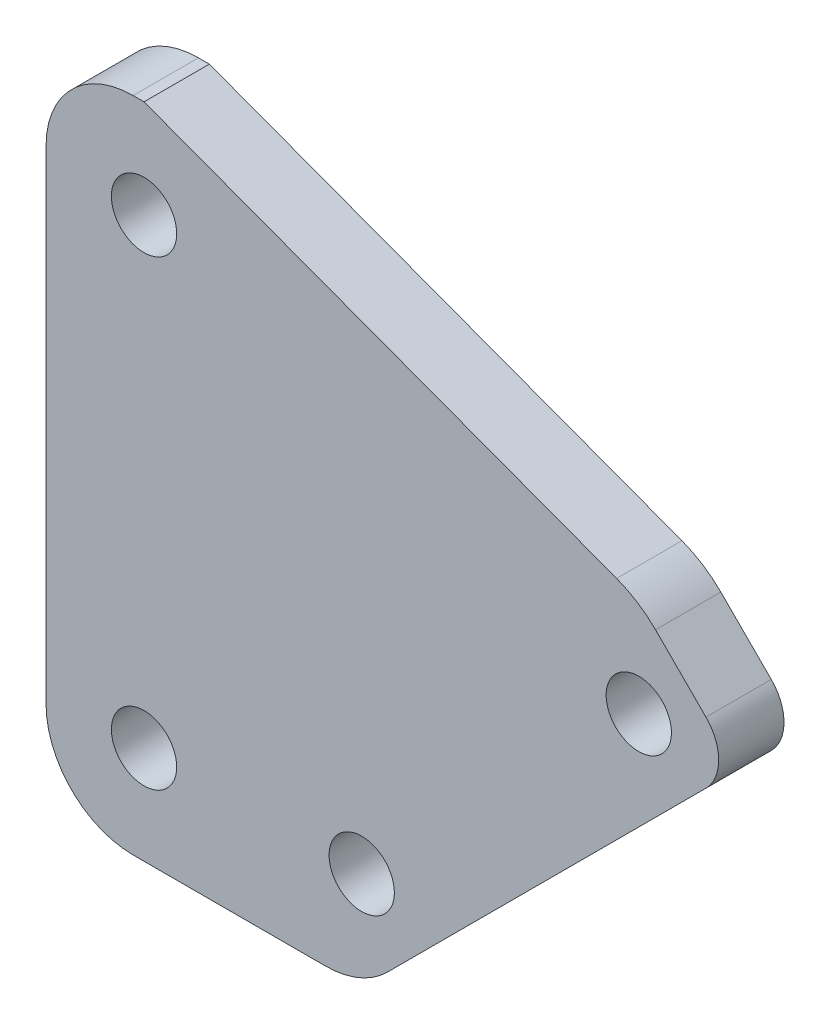
ISO-10303-21;
HEADER;
FILE_DESCRIPTION(('STEP AP214'),'2;1');
FILE_NAME('part.step','',(''),(''),'','','');
FILE_SCHEMA(('AUTOMOTIVE_DESIGN { 1 0 10303 214 1 1 1 1 }'));
ENDSEC;
DATA;
#1=APPLICATION_CONTEXT('core data for automotive mechanical design processes');
#2=APPLICATION_PROTOCOL_DEFINITION('international standard','automotive_design',2000,#1);
#3=PRODUCT_CONTEXT('',#1,'mechanical');
#4=PRODUCT('Part','Part','',(#3));
#5=PRODUCT_RELATED_PRODUCT_CATEGORY('part','',(#4));
#6=PRODUCT_DEFINITION_FORMATION('','',#4);
#7=PRODUCT_DEFINITION_CONTEXT('part definition',#1,'design');
#8=PRODUCT_DEFINITION('design','',#6,#7);
#9=PRODUCT_DEFINITION_SHAPE('','',#8);
#10=(LENGTH_UNIT() NAMED_UNIT(*) SI_UNIT(.MILLI.,.METRE.));
#11=(NAMED_UNIT(*) PLANE_ANGLE_UNIT() SI_UNIT($,.RADIAN.));
#12=(NAMED_UNIT(*) SI_UNIT($,.STERADIAN.) SOLID_ANGLE_UNIT());
#13=UNCERTAINTY_MEASURE_WITH_UNIT(LENGTH_MEASURE(1.E-05),#10,'distance_accuracy_value','');
#14=(GEOMETRIC_REPRESENTATION_CONTEXT(3) GLOBAL_UNCERTAINTY_ASSIGNED_CONTEXT((#13)) GLOBAL_UNIT_ASSIGNED_CONTEXT((#10,
#11,#12)) REPRESENTATION_CONTEXT('',''));
#15=CARTESIAN_POINT('',(0.,0.,0.));
#16=DIRECTION('',(0.,0.,1.));
#17=DIRECTION('',(1.,0.,0.));
#18=AXIS2_PLACEMENT_3D('',#15,#16,#17);
#19=CARTESIAN_POINT('',(12.8431457505076,4.,3.));
#20=DIRECTION('',(0.,0.,-1.));
#21=DIRECTION('',(-1.,0.,0.));
#22=AXIS2_PLACEMENT_3D('',#19,#20,#21);
#23=CYLINDRICAL_SURFACE('',#22,4.);
#24=DIRECTION('',(0.,0.,1.));
#25=VECTOR('',#24,1.);
#26=CARTESIAN_POINT('',(12.8431457505076,0.,3.));
#27=LINE('',#26,#25);
#28=CARTESIAN_POINT('',(12.8431457505076,0.,0.));
#29=VERTEX_POINT('',#28);
#30=CARTESIAN_POINT('',(12.8431457505076,0.,3.));
#31=VERTEX_POINT('',#30);
#32=EDGE_CURVE('E234',#29,#31,#27,.T.);
#33=ORIENTED_EDGE('',*,*,#32,.F.);
#34=CARTESIAN_POINT('',(12.8431457505076,4.,0.));
#35=DIRECTION('',(0.,0.,1.));
#36=DIRECTION('',(1.,0.,0.));
#37=AXIS2_PLACEMENT_3D('',#34,#35,#36);
#38=CIRCLE('',#37,4.);
#39=CARTESIAN_POINT('',(15.6715728752538,1.17157287525381,0.));
#40=VERTEX_POINT('',#39);
#41=EDGE_CURVE('E52',#40,#29,#38,.F.);
#42=ORIENTED_EDGE('',*,*,#41,.F.);
#43=DIRECTION('',(0.,0.,1.));
#44=VECTOR('',#43,1.);
#45=CARTESIAN_POINT('',(15.6715728752538,1.17157287525381,3.));
#46=LINE('',#45,#44);
#47=CARTESIAN_POINT('',(15.6715728752538,1.17157287525381,3.));
#48=VERTEX_POINT('',#47);
#49=EDGE_CURVE('E237',#48,#40,#46,.F.);
#50=ORIENTED_EDGE('',*,*,#49,.F.);
#51=CARTESIAN_POINT('',(12.8431457505076,4.,3.));
#52=DIRECTION('',(0.,0.,1.));
#53=DIRECTION('',(1.,0.,0.));
#54=AXIS2_PLACEMENT_3D('',#51,#52,#53);
#55=CIRCLE('',#54,4.);
#56=EDGE_CURVE('E11',#31,#48,#55,.T.);
#57=ORIENTED_EDGE('',*,*,#56,.F.);
#58=EDGE_LOOP('',(#33,#42,#50,#57));
#59=FACE_BOUND('',#58,.T.);
#60=ADVANCED_FACE('F45',(#59),#23,.T.);
#61=CARTESIAN_POINT('',(4.,4.,3.));
#62=DIRECTION('',(0.,0.,-1.));
#63=DIRECTION('',(-1.,0.,0.));
#64=AXIS2_PLACEMENT_3D('',#61,#62,#63);
#65=CYLINDRICAL_SURFACE('',#64,4.);
#66=DIRECTION('',(0.,0.,1.));
#67=VECTOR('',#66,1.);
#68=CARTESIAN_POINT('',(0.,4.,3.));
#69=LINE('',#68,#67);
#70=CARTESIAN_POINT('',(0.,4.,0.));
#71=VERTEX_POINT('',#70);
#72=CARTESIAN_POINT('',(0.,4.,3.));
#73=VERTEX_POINT('',#72);
#74=EDGE_CURVE('E224',#71,#73,#69,.T.);
#75=ORIENTED_EDGE('',*,*,#74,.F.);
#76=CARTESIAN_POINT('',(4.,4.,0.));
#77=DIRECTION('',(0.,0.,1.));
#78=DIRECTION('',(1.,0.,0.));
#79=AXIS2_PLACEMENT_3D('',#76,#77,#78);
#80=CIRCLE('',#79,4.);
#81=CARTESIAN_POINT('',(4.,0.,0.));
#82=VERTEX_POINT('',#81);
#83=EDGE_CURVE('E230',#82,#71,#80,.F.);
#84=ORIENTED_EDGE('',*,*,#83,.F.);
#85=DIRECTION('',(0.,0.,1.));
#86=VECTOR('',#85,1.);
#87=CARTESIAN_POINT('',(4.,0.,3.));
#88=LINE('',#87,#86);
#89=CARTESIAN_POINT('',(4.,0.,3.));
#90=VERTEX_POINT('',#89);
#91=EDGE_CURVE('E227',#90,#82,#88,.F.);
#92=ORIENTED_EDGE('',*,*,#91,.F.);
#93=CARTESIAN_POINT('',(4.,4.,3.));
#94=DIRECTION('',(0.,0.,1.));
#95=DIRECTION('',(1.,0.,0.));
#96=AXIS2_PLACEMENT_3D('',#93,#94,#95);
#97=CIRCLE('',#96,4.);
#98=EDGE_CURVE('E232',#73,#90,#97,.T.);
#99=ORIENTED_EDGE('',*,*,#98,.F.);
#100=EDGE_LOOP('',(#75,#84,#92,#99));
#101=FACE_BOUND('',#100,.T.);
#102=ADVANCED_FACE('F249',(#101),#65,.T.);
#103=CARTESIAN_POINT('',(4.,26.2132034355964,3.));
#104=DIRECTION('',(0.,0.,-1.));
#105=DIRECTION('',(-1.,0.,0.));
#106=AXIS2_PLACEMENT_3D('',#103,#104,#105);
#107=CYLINDRICAL_SURFACE('',#106,4.);
#108=DIRECTION('',(0.,0.,-1.));
#109=VECTOR('',#108,1.);
#110=CARTESIAN_POINT('',(0.,26.2132034355964,3.));
#111=LINE('',#110,#109);
#112=CARTESIAN_POINT('',(0.,26.2132034355964,3.));
#113=VERTEX_POINT('',#112);
#114=CARTESIAN_POINT('',(0.,26.2132034355964,0.));
#115=VERTEX_POINT('',#114);
#116=EDGE_CURVE('E216',#113,#115,#111,.T.);
#117=ORIENTED_EDGE('',*,*,#116,.F.);
#118=CARTESIAN_POINT('',(4.,26.2132034355964,3.));
#119=DIRECTION('',(0.,0.,1.));
#120=DIRECTION('',(1.,0.,0.));
#121=AXIS2_PLACEMENT_3D('',#118,#119,#120);
#122=CIRCLE('',#121,4.);
#123=CARTESIAN_POINT('',(4.,30.2132034355964,3.));
#124=VERTEX_POINT('',#123);
#125=EDGE_CURVE('E220',#124,#113,#122,.T.);
#126=ORIENTED_EDGE('',*,*,#125,.F.);
#127=DIRECTION('',(0.,0.,-1.));
#128=VECTOR('',#127,1.);
#129=CARTESIAN_POINT('',(4.,30.2132034355964,3.));
#130=LINE('',#129,#128);
#131=CARTESIAN_POINT('',(4.,30.2132034355964,0.));
#132=VERTEX_POINT('',#131);
#133=EDGE_CURVE('E133',#132,#124,#130,.F.);
#134=ORIENTED_EDGE('',*,*,#133,.F.);
#135=CARTESIAN_POINT('',(4.,26.2132034355964,0.));
#136=DIRECTION('',(0.,0.,1.));
#137=DIRECTION('',(1.,0.,0.));
#138=AXIS2_PLACEMENT_3D('',#135,#136,#137);
#139=CIRCLE('',#138,4.);
#140=EDGE_CURVE('E222',#115,#132,#139,.F.);
#141=ORIENTED_EDGE('',*,*,#140,.F.);
#142=EDGE_LOOP('',(#117,#126,#134,#141));
#143=FACE_BOUND('',#142,.T.);
#144=ADVANCED_FACE('F255',(#143),#107,.T.);
#145=CARTESIAN_POINT('',(24.4609098339235,17.4238664769267,3.));
#146=DIRECTION('',(0.,0.,1.));
#147=DIRECTION('',(1.,0.,0.));
#148=AXIS2_PLACEMENT_3D('',#145,#146,#147);
#149=CYLINDRICAL_SURFACE('',#148,5.);
#150=DIRECTION('',(0.,0.,1.));
#151=VECTOR('',#150,1.);
#152=CARTESIAN_POINT('',(27.9964437398562,20.9594003828594,3.));
#153=LINE('',#152,#151);
#154=CARTESIAN_POINT('',(27.9964437398562,20.9594003828594,0.));
#155=VERTEX_POINT('',#154);
#156=CARTESIAN_POINT('',(27.9964437398562,20.9594003828594,3.));
#157=VERTEX_POINT('',#156);
#158=EDGE_CURVE('E208',#155,#157,#153,.T.);
#159=ORIENTED_EDGE('',*,*,#158,.F.);
#160=CARTESIAN_POINT('',(24.4609098339235,17.4238664769267,0.));
#161=DIRECTION('',(0.,0.,1.));
#162=DIRECTION('',(1.,0.,0.));
#163=AXIS2_PLACEMENT_3D('',#160,#161,#162);
#164=CIRCLE('',#163,5.);
#165=CARTESIAN_POINT('',(26.2097151151635,22.1080611876862,0.));
#166=VERTEX_POINT('',#165);
#167=EDGE_CURVE('E213',#166,#155,#164,.F.);
#168=ORIENTED_EDGE('',*,*,#167,.F.);
#169=DIRECTION('',(0.,0.,1.));
#170=VECTOR('',#169,1.);
#171=CARTESIAN_POINT('',(26.2097151151635,22.1080611876862,3.));
#172=LINE('',#171,#170);
#173=CARTESIAN_POINT('',(26.2097151151635,22.1080611876862,3.));
#174=VERTEX_POINT('',#173);
#175=EDGE_CURVE('E211',#174,#166,#172,.F.);
#176=ORIENTED_EDGE('',*,*,#175,.F.);
#177=CARTESIAN_POINT('',(24.4609098339235,17.4238664769267,3.));
#178=DIRECTION('',(0.,0.,1.));
#179=DIRECTION('',(1.,0.,0.));
#180=AXIS2_PLACEMENT_3D('',#177,#178,#179);
#181=CIRCLE('',#180,5.);
#182=EDGE_CURVE('E151',#157,#174,#181,.T.);
#183=ORIENTED_EDGE('',*,*,#182,.F.);
#184=EDGE_LOOP('',(#159,#168,#176,#183));
#185=FACE_BOUND('',#184,.T.);
#186=ADVANCED_FACE('F277',(#185),#149,.T.);
#187=CARTESIAN_POINT('',(28.8994949366117,17.2279220613578,3.));
#188=DIRECTION('',(0.,0.,1.));
#189=DIRECTION('',(1.,0.,0.));
#190=AXIS2_PLACEMENT_3D('',#187,#188,#189);
#191=CYLINDRICAL_SURFACE('',#190,2.);
#192=DIRECTION('',(0.,0.,1.));
#193=VECTOR('',#192,1.);
#194=CARTESIAN_POINT('',(30.3137084989847,15.8137084989848,3.));
#195=LINE('',#194,#193);
#196=CARTESIAN_POINT('',(30.3137084989847,15.8137084989848,0.));
#197=VERTEX_POINT('',#196);
#198=CARTESIAN_POINT('',(30.3137084989847,15.8137084989848,3.));
#199=VERTEX_POINT('',#198);
#200=EDGE_CURVE('E145',#197,#199,#195,.T.);
#201=ORIENTED_EDGE('',*,*,#200,.F.);
#202=CARTESIAN_POINT('',(28.8994949366117,17.2279220613578,0.));
#203=DIRECTION('',(0.,0.,1.));
#204=DIRECTION('',(1.,0.,0.));
#205=AXIS2_PLACEMENT_3D('',#202,#203,#204);
#206=CIRCLE('',#205,2.);
#207=CARTESIAN_POINT('',(30.3137084989847,18.6421356237309,0.));
#208=VERTEX_POINT('',#207);
#209=EDGE_CURVE('E203',#208,#197,#206,.F.);
#210=ORIENTED_EDGE('',*,*,#209,.F.);
#211=DIRECTION('',(0.,0.,1.));
#212=VECTOR('',#211,1.);
#213=CARTESIAN_POINT('',(30.3137084989847,18.6421356237309,3.));
#214=LINE('',#213,#212);
#215=CARTESIAN_POINT('',(30.3137084989847,18.6421356237309,3.));
#216=VERTEX_POINT('',#215);
#217=EDGE_CURVE('E200',#216,#208,#214,.F.);
#218=ORIENTED_EDGE('',*,*,#217,.F.);
#219=CARTESIAN_POINT('',(28.8994949366117,17.2279220613578,3.));
#220=DIRECTION('',(0.,0.,1.));
#221=DIRECTION('',(1.,0.,0.));
#222=AXIS2_PLACEMENT_3D('',#219,#220,#221);
#223=CIRCLE('',#222,2.);
#224=EDGE_CURVE('E205',#199,#216,#223,.T.);
#225=ORIENTED_EDGE('',*,*,#224,.F.);
#226=EDGE_LOOP('',(#201,#210,#218,#225));
#227=FACE_BOUND('',#226,.T.);
#228=ADVANCED_FACE('F282',(#227),#191,.T.);
#229=CARTESIAN_POINT('',(7.24999999999999,-7.25,3.));
#230=DIRECTION('',(0.707106781186547,-0.707106781186548,0.));
#231=DIRECTION('',(0.707106781186548,0.707106781186547,0.));
#232=AXIS2_PLACEMENT_3D('',#229,#230,#231);
#233=PLANE('',#232);
#234=DIRECTION('',(-0.707106781186548,-0.707106781186547,0.));
#235=VECTOR('',#234,1.);
#236=CARTESIAN_POINT('',(7.24999999999999,-7.25,3.));
#237=LINE('',#236,#235);
#238=EDGE_CURVE('E155',#199,#48,#237,.T.);
#239=ORIENTED_EDGE('',*,*,#238,.T.);
#240=ORIENTED_EDGE('',*,*,#49,.T.);
#241=DIRECTION('',(-0.707106781186548,-0.707106781186547,0.));
#242=VECTOR('',#241,1.);
#243=CARTESIAN_POINT('',(7.24999999999999,-7.25,0.));
#244=LINE('',#243,#242);
#245=EDGE_CURVE('E173',#197,#40,#244,.T.);
#246=ORIENTED_EDGE('',*,*,#245,.F.);
#247=ORIENTED_EDGE('',*,*,#200,.T.);
#248=EDGE_LOOP('',(#239,#240,#246,#247));
#249=FACE_BOUND('',#248,.T.);
#250=ADVANCED_FACE('F286',(#249),#233,.T.);
#251=CARTESIAN_POINT('',(24.4779220613578,24.4779220613578,3.));
#252=DIRECTION('',(0.707106781186547,0.707106781186547,0.));
#253=DIRECTION('',(-0.707106781186548,0.707106781186548,0.));
#254=AXIS2_PLACEMENT_3D('',#251,#252,#253);
#255=PLANE('',#254);
#256=DIRECTION('',(0.707106781186548,-0.707106781186548,0.));
#257=VECTOR('',#256,1.);
#258=CARTESIAN_POINT('',(24.4779220613578,24.4779220613578,0.));
#259=LINE('',#258,#257);
#260=EDGE_CURVE('E176',#155,#208,#259,.T.);
#261=ORIENTED_EDGE('',*,*,#260,.F.);
#262=ORIENTED_EDGE('',*,*,#158,.T.);
#263=DIRECTION('',(0.707106781186548,-0.707106781186548,0.));
#264=VECTOR('',#263,1.);
#265=CARTESIAN_POINT('',(24.4779220613578,24.4779220613578,3.));
#266=LINE('',#265,#264);
#267=EDGE_CURVE('E153',#157,#216,#266,.T.);
#268=ORIENTED_EDGE('',*,*,#267,.T.);
#269=ORIENTED_EDGE('',*,*,#217,.T.);
#270=EDGE_LOOP('',(#261,#262,#268,#269));
#271=FACE_BOUND('',#270,.T.);
#272=ADVANCED_FACE('F290',(#271),#255,.T.);
#273=CARTESIAN_POINT('',(10.4504512447422,27.9916517698077,3.));
#274=DIRECTION('',(0.349761056248004,0.936838942151894,0.));
#275=DIRECTION('',(-0.936838942151894,0.349761056248004,0.));
#276=AXIS2_PLACEMENT_3D('',#273,#274,#275);
#277=PLANE('',#276);
#278=DIRECTION('',(0.936838942151894,-0.349761056248004,0.));
#279=VECTOR('',#278,1.);
#280=CARTESIAN_POINT('',(10.4504512447422,27.9916517698077,3.));
#281=LINE('',#280,#279);
#282=CARTESIAN_POINT('',(4.49999999999999,30.2132034355964,3.));
#283=VERTEX_POINT('',#282);
#284=EDGE_CURVE('E137',#283,#174,#281,.T.);
#285=ORIENTED_EDGE('',*,*,#284,.T.);
#286=ORIENTED_EDGE('',*,*,#175,.T.);
#287=DIRECTION('',(0.936838942151894,-0.349761056248004,0.));
#288=VECTOR('',#287,1.);
#289=CARTESIAN_POINT('',(10.4504512447422,27.9916517698077,0.));
#290=LINE('',#289,#288);
#291=CARTESIAN_POINT('',(4.49999999999999,30.2132034355964,0.));
#292=VERTEX_POINT('',#291);
#293=EDGE_CURVE('E144',#292,#166,#290,.T.);
#294=ORIENTED_EDGE('',*,*,#293,.F.);
#295=DIRECTION('',(0.,0.,-1.));
#296=VECTOR('',#295,1.);
#297=CARTESIAN_POINT('',(4.49999999999999,30.2132034355964,3.));
#298=LINE('',#297,#296);
#299=EDGE_CURVE('E130',#283,#292,#298,.T.);
#300=ORIENTED_EDGE('',*,*,#299,.F.);
#301=EDGE_LOOP('',(#285,#286,#294,#300));
#302=FACE_BOUND('',#301,.T.);
#303=ADVANCED_FACE('F141',(#302),#277,.T.);
#304=CARTESIAN_POINT('',(0.,30.2132034355964,3.));
#305=DIRECTION('',(0.,1.,0.));
#306=DIRECTION('',(0.,0.,1.));
#307=AXIS2_PLACEMENT_3D('',#304,#305,#306);
#308=PLANE('',#307);
#309=DIRECTION('',(1.,0.,0.));
#310=VECTOR('',#309,1.);
#311=CARTESIAN_POINT('',(0.,30.2132034355964,0.));
#312=LINE('',#311,#310);
#313=EDGE_CURVE('E179',#132,#292,#312,.T.);
#314=ORIENTED_EDGE('',*,*,#313,.F.);
#315=ORIENTED_EDGE('',*,*,#133,.T.);
#316=DIRECTION('',(1.,0.,0.));
#317=VECTOR('',#316,1.);
#318=CARTESIAN_POINT('',(0.,30.2132034355964,3.));
#319=LINE('',#318,#317);
#320=EDGE_CURVE('E126',#124,#283,#319,.T.);
#321=ORIENTED_EDGE('',*,*,#320,.T.);
#322=ORIENTED_EDGE('',*,*,#299,.T.);
#323=EDGE_LOOP('',(#314,#315,#321,#322));
#324=FACE_BOUND('',#323,.T.);
#325=ADVANCED_FACE('F129',(#324),#308,.T.);
#326=CARTESIAN_POINT('',(0.,0.,3.));
#327=DIRECTION('',(-1.,0.,0.));
#328=DIRECTION('',(0.,0.,1.));
#329=AXIS2_PLACEMENT_3D('',#326,#327,#328);
#330=PLANE('',#329);
#331=DIRECTION('',(0.,1.,0.));
#332=VECTOR('',#331,1.);
#333=CARTESIAN_POINT('',(0.,0.,0.));
#334=LINE('',#333,#332);
#335=EDGE_CURVE('E181',#71,#115,#334,.T.);
#336=ORIENTED_EDGE('',*,*,#335,.F.);
#337=ORIENTED_EDGE('',*,*,#74,.T.);
#338=DIRECTION('',(0.,1.,0.));
#339=VECTOR('',#338,1.);
#340=CARTESIAN_POINT('',(0.,0.,3.));
#341=LINE('',#340,#339);
#342=EDGE_CURVE('E136',#73,#113,#341,.T.);
#343=ORIENTED_EDGE('',*,*,#342,.T.);
#344=ORIENTED_EDGE('',*,*,#116,.T.);
#345=EDGE_LOOP('',(#336,#337,#343,#344));
#346=FACE_BOUND('',#345,.T.);
#347=ADVANCED_FACE('F256',(#346),#330,.T.);
#348=CARTESIAN_POINT('',(4.49999999999999,25.7132034355964,3.));
#349=DIRECTION('',(0.,0.,-1.));
#350=DIRECTION('',(-1.,0.,0.));
#351=AXIS2_PLACEMENT_3D('',#348,#349,#350);
#352=CYLINDRICAL_SURFACE('',#351,1.5);
#353=CARTESIAN_POINT('',(4.49999999999999,25.7132034355964,3.));
#354=DIRECTION('',(0.,0.,1.));
#355=DIRECTION('',(1.,0.,0.));
#356=AXIS2_PLACEMENT_3D('',#353,#354,#355);
#357=CIRCLE('',#356,1.5);
#358=CARTESIAN_POINT('',(5.99999999999999,25.7132034355964,3.));
#359=VERTEX_POINT('',#358);
#360=EDGE_CURVE('E168',#359,#359,#357,.T.);
#361=ORIENTED_EDGE('',*,*,#360,.T.);
#362=EDGE_LOOP('',(#361));
#363=FACE_BOUND('',#362,.T.);
#364=CARTESIAN_POINT('',(4.49999999999999,25.7132034355964,0.));
#365=DIRECTION('',(0.,0.,1.));
#366=DIRECTION('',(1.,0.,0.));
#367=AXIS2_PLACEMENT_3D('',#364,#365,#366);
#368=CIRCLE('',#367,1.5);
#369=CARTESIAN_POINT('',(5.99999999999999,25.7132034355964,0.));
#370=VERTEX_POINT('',#369);
#371=EDGE_CURVE('E192',#370,#370,#368,.T.);
#372=ORIENTED_EDGE('',*,*,#371,.F.);
#373=EDGE_LOOP('',(#372));
#374=FACE_BOUND('',#373,.T.);
#375=ADVANCED_FACE('F259',(#363,#374),#352,.F.);
#376=CARTESIAN_POINT('',(4.49999999999999,4.49999999999999,3.));
#377=DIRECTION('',(0.,0.,-1.));
#378=DIRECTION('',(-1.,0.,0.));
#379=AXIS2_PLACEMENT_3D('',#376,#377,#378);
#380=CYLINDRICAL_SURFACE('',#379,1.49999999999999);
#381=CARTESIAN_POINT('',(4.49999999999999,4.49999999999999,3.));
#382=DIRECTION('',(0.,0.,1.));
#383=DIRECTION('',(1.,0.,0.));
#384=AXIS2_PLACEMENT_3D('',#381,#382,#383);
#385=CIRCLE('',#384,1.49999999999999);
#386=CARTESIAN_POINT('',(5.99999999999999,4.49999999999999,3.));
#387=VERTEX_POINT('',#386);
#388=EDGE_CURVE('E165',#387,#387,#385,.T.);
#389=ORIENTED_EDGE('',*,*,#388,.T.);
#390=EDGE_LOOP('',(#389));
#391=FACE_BOUND('',#390,.T.);
#392=CARTESIAN_POINT('',(4.49999999999999,4.49999999999999,0.));
#393=DIRECTION('',(0.,0.,1.));
#394=DIRECTION('',(1.,0.,0.));
#395=AXIS2_PLACEMENT_3D('',#392,#393,#394);
#396=CIRCLE('',#395,1.49999999999999);
#397=CARTESIAN_POINT('',(5.99999999999999,4.49999999999999,0.));
#398=VERTEX_POINT('',#397);
#399=EDGE_CURVE('E189',#398,#398,#396,.T.);
#400=ORIENTED_EDGE('',*,*,#399,.F.);
#401=EDGE_LOOP('',(#400));
#402=FACE_BOUND('',#401,.T.);
#403=ADVANCED_FACE('F265',(#391,#402),#380,.F.);
#404=CARTESIAN_POINT('',(27.2279220613578,17.2279220613578,3.));
#405=DIRECTION('',(0.,0.,-1.));
#406=DIRECTION('',(-1.,0.,0.));
#407=AXIS2_PLACEMENT_3D('',#404,#405,#406);
#408=CYLINDRICAL_SURFACE('',#407,1.5);
#409=CARTESIAN_POINT('',(27.2279220613578,17.2279220613578,3.));
#410=DIRECTION('',(0.,0.,1.));
#411=DIRECTION('',(1.,0.,0.));
#412=AXIS2_PLACEMENT_3D('',#409,#410,#411);
#413=CIRCLE('',#412,1.5);
#414=CARTESIAN_POINT('',(28.7279220613578,17.2279220613578,3.));
#415=VERTEX_POINT('',#414);
#416=EDGE_CURVE('E162',#415,#415,#413,.T.);
#417=ORIENTED_EDGE('',*,*,#416,.T.);
#418=EDGE_LOOP('',(#417));
#419=FACE_BOUND('',#418,.T.);
#420=CARTESIAN_POINT('',(27.2279220613578,17.2279220613578,0.));
#421=DIRECTION('',(0.,0.,1.));
#422=DIRECTION('',(1.,0.,0.));
#423=AXIS2_PLACEMENT_3D('',#420,#421,#422);
#424=CIRCLE('',#423,1.5);
#425=CARTESIAN_POINT('',(28.7279220613578,17.2279220613578,0.));
#426=VERTEX_POINT('',#425);
#427=EDGE_CURVE('E186',#426,#426,#424,.T.);
#428=ORIENTED_EDGE('',*,*,#427,.F.);
#429=EDGE_LOOP('',(#428));
#430=FACE_BOUND('',#429,.T.);
#431=ADVANCED_FACE('F342',(#419,#430),#408,.F.);
#432=CARTESIAN_POINT('',(0.,0.,3.));
#433=DIRECTION('',(0.,1.,0.));
#434=DIRECTION('',(-1.,0.,0.));
#435=AXIS2_PLACEMENT_3D('',#432,#433,#434);
#436=PLANE('',#435);
#437=DIRECTION('',(1.,0.,0.));
#438=VECTOR('',#437,1.);
#439=CARTESIAN_POINT('',(0.,0.,0.));
#440=LINE('',#439,#438);
#441=EDGE_CURVE('E183',#82,#29,#440,.T.);
#442=ORIENTED_EDGE('',*,*,#441,.T.);
#443=ORIENTED_EDGE('',*,*,#32,.T.);
#444=DIRECTION('',(1.,0.,0.));
#445=VECTOR('',#444,1.);
#446=CARTESIAN_POINT('',(0.,0.,3.));
#447=LINE('',#446,#445);
#448=EDGE_CURVE('E160',#90,#31,#447,.T.);
#449=ORIENTED_EDGE('',*,*,#448,.F.);
#450=ORIENTED_EDGE('',*,*,#91,.T.);
#451=EDGE_LOOP('',(#442,#443,#449,#450));
#452=FACE_BOUND('',#451,.T.);
#453=ADVANCED_FACE('F245',(#452),#436,.F.);
#454=CARTESIAN_POINT('',(14.5,4.49999999999999,3.));
#455=DIRECTION('',(0.,0.,-1.));
#456=DIRECTION('',(-1.,0.,0.));
#457=AXIS2_PLACEMENT_3D('',#454,#455,#456);
#458=CYLINDRICAL_SURFACE('',#457,1.5);
#459=CARTESIAN_POINT('',(14.5,4.49999999999999,3.));
#460=DIRECTION('',(0.,0.,1.));
#461=DIRECTION('',(1.,0.,0.));
#462=AXIS2_PLACEMENT_3D('',#459,#460,#461);
#463=CIRCLE('',#462,1.5);
#464=CARTESIAN_POINT('',(16.,4.49999999999999,3.));
#465=VERTEX_POINT('',#464);
#466=EDGE_CURVE('E146',#465,#465,#463,.T.);
#467=ORIENTED_EDGE('',*,*,#466,.T.);
#468=EDGE_LOOP('',(#467));
#469=FACE_BOUND('',#468,.T.);
#470=CARTESIAN_POINT('',(14.5,4.49999999999999,0.));
#471=DIRECTION('',(0.,0.,1.));
#472=DIRECTION('',(1.,0.,0.));
#473=AXIS2_PLACEMENT_3D('',#470,#471,#472);
#474=CIRCLE('',#473,1.5);
#475=CARTESIAN_POINT('',(16.,4.49999999999999,0.));
#476=VERTEX_POINT('',#475);
#477=EDGE_CURVE('E195',#476,#476,#474,.T.);
#478=ORIENTED_EDGE('',*,*,#477,.F.);
#479=EDGE_LOOP('',(#478));
#480=FACE_BOUND('',#479,.T.);
#481=ADVANCED_FACE('F341',(#469,#480),#458,.F.);
#482=CARTESIAN_POINT('',(0.,0.,3.));
#483=DIRECTION('',(0.,0.,1.));
#484=DIRECTION('',(1.,0.,0.));
#485=AXIS2_PLACEMENT_3D('',#482,#483,#484);
#486=PLANE('',#485);
#487=ORIENTED_EDGE('',*,*,#448,.T.);
#488=ORIENTED_EDGE('',*,*,#56,.T.);
#489=ORIENTED_EDGE('',*,*,#238,.F.);
#490=ORIENTED_EDGE('',*,*,#224,.T.);
#491=ORIENTED_EDGE('',*,*,#267,.F.);
#492=ORIENTED_EDGE('',*,*,#182,.T.);
#493=ORIENTED_EDGE('',*,*,#284,.F.);
#494=ORIENTED_EDGE('',*,*,#320,.F.);
#495=ORIENTED_EDGE('',*,*,#125,.T.);
#496=ORIENTED_EDGE('',*,*,#342,.F.);
#497=ORIENTED_EDGE('',*,*,#98,.T.);
#498=EDGE_LOOP('',(#487,#488,#489,#490,#491,#492,#493,#494,#495,#496,#497));
#499=FACE_BOUND('',#498,.T.);
#500=ORIENTED_EDGE('',*,*,#416,.F.);
#501=EDGE_LOOP('',(#500));
#502=FACE_BOUND('',#501,.T.);
#503=ORIENTED_EDGE('',*,*,#388,.F.);
#504=EDGE_LOOP('',(#503));
#505=FACE_BOUND('',#504,.T.);
#506=ORIENTED_EDGE('',*,*,#360,.F.);
#507=EDGE_LOOP('',(#506));
#508=FACE_BOUND('',#507,.T.);
#509=ORIENTED_EDGE('',*,*,#466,.F.);
#510=EDGE_LOOP('',(#509));
#511=FACE_BOUND('',#510,.T.);
#512=ADVANCED_FACE('F148',(#499,#502,#505,#508,#511),#486,.T.);
#513=CARTESIAN_POINT('',(0.,0.,0.));
#514=DIRECTION('',(0.,0.,1.));
#515=DIRECTION('',(1.,0.,0.));
#516=AXIS2_PLACEMENT_3D('',#513,#514,#515);
#517=PLANE('',#516);
#518=ORIENTED_EDGE('',*,*,#245,.T.);
#519=ORIENTED_EDGE('',*,*,#41,.T.);
#520=ORIENTED_EDGE('',*,*,#441,.F.);
#521=ORIENTED_EDGE('',*,*,#83,.T.);
#522=ORIENTED_EDGE('',*,*,#335,.T.);
#523=ORIENTED_EDGE('',*,*,#140,.T.);
#524=ORIENTED_EDGE('',*,*,#313,.T.);
#525=ORIENTED_EDGE('',*,*,#293,.T.);
#526=ORIENTED_EDGE('',*,*,#167,.T.);
#527=ORIENTED_EDGE('',*,*,#260,.T.);
#528=ORIENTED_EDGE('',*,*,#209,.T.);
#529=EDGE_LOOP('',(#518,#519,#520,#521,#522,#523,#524,#525,#526,#527,#528));
#530=FACE_BOUND('',#529,.T.);
#531=ORIENTED_EDGE('',*,*,#427,.T.);
#532=EDGE_LOOP('',(#531));
#533=FACE_BOUND('',#532,.T.);
#534=ORIENTED_EDGE('',*,*,#399,.T.);
#535=EDGE_LOOP('',(#534));
#536=FACE_BOUND('',#535,.T.);
#537=ORIENTED_EDGE('',*,*,#371,.T.);
#538=EDGE_LOOP('',(#537));
#539=FACE_BOUND('',#538,.T.);
#540=ORIENTED_EDGE('',*,*,#477,.T.);
#541=EDGE_LOOP('',(#540));
#542=FACE_BOUND('',#541,.T.);
#543=ADVANCED_FACE('F240',(#530,#533,#536,#539,#542),#517,.F.);
#544=CLOSED_SHELL('',(#60,#102,#144,#186,#228,#250,#272,#303,#325,#347,#375,#403,#431,#453,#481,
#512,#543));
#545=MANIFOLD_SOLID_BREP('B2',#544);
#546=ADVANCED_BREP_SHAPE_REPRESENTATION('',(#18,#545),#14);
#547=SHAPE_DEFINITION_REPRESENTATION(#9,#546);
ENDSEC;
END-ISO-10303-21;
